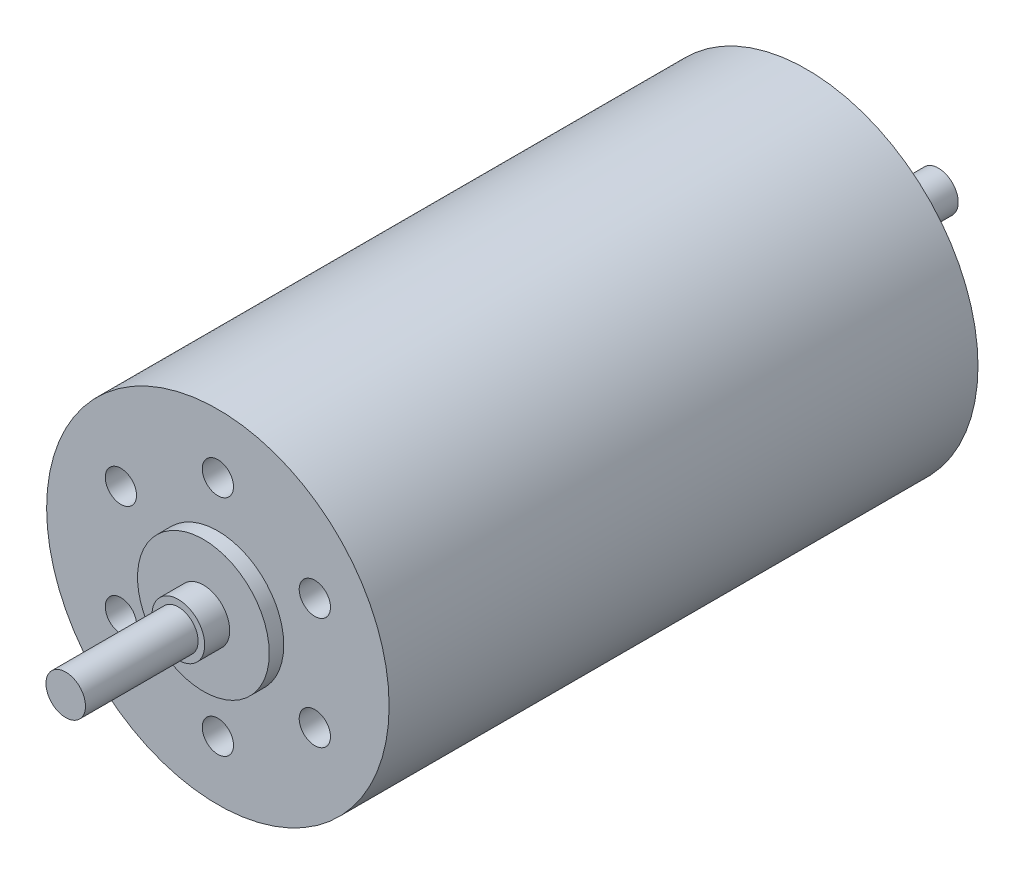
ISO-10303-21;
HEADER;
FILE_DESCRIPTION(('STEP AP214'),'2;1');
FILE_NAME('part.step','',(''),(''),'','','');
FILE_SCHEMA(('AUTOMOTIVE_DESIGN { 1 0 10303 214 1 1 1 1 }'));
ENDSEC;
DATA;
#1=APPLICATION_CONTEXT('core data for automotive mechanical design processes');
#2=APPLICATION_PROTOCOL_DEFINITION('international standard','automotive_design',2000,#1);
#3=PRODUCT_CONTEXT('',#1,'mechanical');
#4=PRODUCT('Part','Part','',(#3));
#5=PRODUCT_RELATED_PRODUCT_CATEGORY('part','',(#4));
#6=PRODUCT_DEFINITION_FORMATION('','',#4);
#7=PRODUCT_DEFINITION_CONTEXT('part definition',#1,'design');
#8=PRODUCT_DEFINITION('design','',#6,#7);
#9=PRODUCT_DEFINITION_SHAPE('','',#8);
#10=(LENGTH_UNIT() NAMED_UNIT(*) SI_UNIT(.MILLI.,.METRE.));
#11=(NAMED_UNIT(*) PLANE_ANGLE_UNIT() SI_UNIT($,.RADIAN.));
#12=(NAMED_UNIT(*) SI_UNIT($,.STERADIAN.) SOLID_ANGLE_UNIT());
#13=UNCERTAINTY_MEASURE_WITH_UNIT(LENGTH_MEASURE(1.E-05),#10,'distance_accuracy_value','');
#14=(GEOMETRIC_REPRESENTATION_CONTEXT(3) GLOBAL_UNCERTAINTY_ASSIGNED_CONTEXT((#13)) GLOBAL_UNIT_ASSIGNED_CONTEXT((#10,
#11,#12)) REPRESENTATION_CONTEXT('',''));
#15=CARTESIAN_POINT('',(0.,0.,0.));
#16=DIRECTION('',(0.,0.,1.));
#17=DIRECTION('',(1.,0.,0.));
#18=AXIS2_PLACEMENT_3D('',#15,#16,#17);
#19=CARTESIAN_POINT('',(0.,0.,22.35));
#20=DIRECTION('',(0.,0.,-1.));
#21=DIRECTION('',(-1.,0.,0.));
#22=AXIS2_PLACEMENT_3D('',#19,#20,#21);
#23=CYLINDRICAL_SURFACE('',#22,13.);
#24=CARTESIAN_POINT('',(0.,0.,22.35));
#25=DIRECTION('',(0.,0.,1.));
#26=DIRECTION('',(1.,0.,0.));
#27=AXIS2_PLACEMENT_3D('',#24,#25,#26);
#28=CIRCLE('',#27,13.);
#29=CARTESIAN_POINT('',(13.,0.,22.35));
#30=VERTEX_POINT('',#29);
#31=EDGE_CURVE('E165',#30,#30,#28,.T.);
#32=ORIENTED_EDGE('',*,*,#31,.F.);
#33=EDGE_LOOP('',(#32));
#34=FACE_BOUND('',#33,.T.);
#35=CARTESIAN_POINT('',(0.,0.,-22.35));
#36=DIRECTION('',(0.,0.,1.));
#37=DIRECTION('',(1.,0.,0.));
#38=AXIS2_PLACEMENT_3D('',#35,#36,#37);
#39=CIRCLE('',#38,13.);
#40=CARTESIAN_POINT('',(13.,0.,-22.35));
#41=VERTEX_POINT('',#40);
#42=EDGE_CURVE('E48',#41,#41,#39,.T.);
#43=ORIENTED_EDGE('',*,*,#42,.T.);
#44=EDGE_LOOP('',(#43));
#45=FACE_BOUND('',#44,.T.);
#46=ADVANCED_FACE('F45',(#34,#45),#23,.T.);
#47=CARTESIAN_POINT('',(0.,0.,22.35));
#48=DIRECTION('',(0.,0.,1.));
#49=DIRECTION('',(1.,0.,0.));
#50=AXIS2_PLACEMENT_3D('',#47,#48,#49);
#51=PLANE('',#50);
#52=CARTESIAN_POINT('',(7.36121593216774,-4.24999999999998,22.35));
#53=DIRECTION('',(0.,0.,1.));
#54=DIRECTION('',(1.,0.,0.));
#55=AXIS2_PLACEMENT_3D('',#52,#53,#54);
#56=CIRCLE('',#55,1.18744999999999);
#57=CARTESIAN_POINT('',(8.54866593216773,-4.24999999999998,22.35));
#58=VERTEX_POINT('',#57);
#59=EDGE_CURVE('E86',#58,#58,#56,.T.);
#60=ORIENTED_EDGE('',*,*,#59,.F.);
#61=EDGE_LOOP('',(#60));
#62=FACE_BOUND('',#61,.T.);
#63=CARTESIAN_POINT('',(0.,8.5,22.35));
#64=DIRECTION('',(0.,0.,1.));
#65=DIRECTION('',(1.,0.,0.));
#66=AXIS2_PLACEMENT_3D('',#63,#64,#65);
#67=CIRCLE('',#66,1.18744999999999);
#68=CARTESIAN_POINT('',(1.18744999999999,8.5,22.35));
#69=VERTEX_POINT('',#68);
#70=EDGE_CURVE('E85',#69,#69,#67,.T.);
#71=ORIENTED_EDGE('',*,*,#70,.F.);
#72=EDGE_LOOP('',(#71));
#73=FACE_BOUND('',#72,.T.);
#74=CARTESIAN_POINT('',(-7.36121593216774,4.24999999999998,22.35));
#75=DIRECTION('',(0.,0.,1.));
#76=DIRECTION('',(1.,0.,0.));
#77=AXIS2_PLACEMENT_3D('',#74,#75,#76);
#78=CIRCLE('',#77,1.18744999999999);
#79=CARTESIAN_POINT('',(-6.17376593216775,4.24999999999998,22.35));
#80=VERTEX_POINT('',#79);
#81=EDGE_CURVE('E99',#80,#80,#78,.T.);
#82=ORIENTED_EDGE('',*,*,#81,.F.);
#83=EDGE_LOOP('',(#82));
#84=FACE_BOUND('',#83,.T.);
#85=CARTESIAN_POINT('',(-7.36121593216774,-4.24999999999998,22.35));
#86=DIRECTION('',(0.,0.,1.));
#87=DIRECTION('',(1.,0.,0.));
#88=AXIS2_PLACEMENT_3D('',#85,#86,#87);
#89=CIRCLE('',#88,1.18744999999999);
#90=CARTESIAN_POINT('',(-6.17376593216775,-4.24999999999998,22.35));
#91=VERTEX_POINT('',#90);
#92=EDGE_CURVE('E107',#91,#91,#89,.T.);
#93=ORIENTED_EDGE('',*,*,#92,.F.);
#94=EDGE_LOOP('',(#93));
#95=FACE_BOUND('',#94,.T.);
#96=CARTESIAN_POINT('',(7.36121593216774,4.24999999999998,22.35));
#97=DIRECTION('',(0.,0.,1.));
#98=DIRECTION('',(1.,0.,0.));
#99=AXIS2_PLACEMENT_3D('',#96,#97,#98);
#100=CIRCLE('',#99,1.18744999999999);
#101=CARTESIAN_POINT('',(8.54866593216773,4.24999999999998,22.35));
#102=VERTEX_POINT('',#101);
#103=EDGE_CURVE('E115',#102,#102,#100,.T.);
#104=ORIENTED_EDGE('',*,*,#103,.F.);
#105=EDGE_LOOP('',(#104));
#106=FACE_BOUND('',#105,.T.);
#107=CARTESIAN_POINT('',(0.,-8.5,22.35));
#108=DIRECTION('',(0.,0.,1.));
#109=DIRECTION('',(1.,0.,0.));
#110=AXIS2_PLACEMENT_3D('',#107,#108,#109);
#111=CIRCLE('',#110,1.18744999999999);
#112=CARTESIAN_POINT('',(1.18744999999999,-8.5,22.35));
#113=VERTEX_POINT('',#112);
#114=EDGE_CURVE('E123',#113,#113,#111,.T.);
#115=ORIENTED_EDGE('',*,*,#114,.F.);
#116=EDGE_LOOP('',(#115));
#117=FACE_BOUND('',#116,.T.);
#118=CARTESIAN_POINT('',(0.,0.,22.35));
#119=DIRECTION('',(0.,0.,1.));
#120=DIRECTION('',(1.,0.,0.));
#121=AXIS2_PLACEMENT_3D('',#118,#119,#120);
#122=CIRCLE('',#121,5.);
#123=CARTESIAN_POINT('',(5.,0.,22.35));
#124=VERTEX_POINT('',#123);
#125=EDGE_CURVE('E159',#124,#124,#122,.T.);
#126=ORIENTED_EDGE('',*,*,#125,.F.);
#127=EDGE_LOOP('',(#126));
#128=FACE_BOUND('',#127,.T.);
#129=ORIENTED_EDGE('',*,*,#31,.T.);
#130=EDGE_LOOP('',(#129));
#131=FACE_BOUND('',#130,.T.);
#132=ADVANCED_FACE('F178',(#62,#73,#84,#95,#106,#117,#128,#131),#51,.T.);
#133=CARTESIAN_POINT('',(0.,0.,-22.35));
#134=DIRECTION('',(0.,0.,1.));
#135=DIRECTION('',(1.,0.,0.));
#136=AXIS2_PLACEMENT_3D('',#133,#134,#135);
#137=PLANE('',#136);
#138=CARTESIAN_POINT('',(0.,0.,-22.35));
#139=DIRECTION('',(0.,0.,-1.));
#140=DIRECTION('',(-1.,0.,0.));
#141=AXIS2_PLACEMENT_3D('',#138,#139,#140);
#142=CIRCLE('',#141,4.);
#143=CARTESIAN_POINT('',(-4.,0.,-22.35));
#144=VERTEX_POINT('',#143);
#145=EDGE_CURVE('E54',#144,#144,#142,.T.);
#146=ORIENTED_EDGE('',*,*,#145,.F.);
#147=EDGE_LOOP('',(#146));
#148=FACE_BOUND('',#147,.T.);
#149=ORIENTED_EDGE('',*,*,#42,.F.);
#150=EDGE_LOOP('',(#149));
#151=FACE_BOUND('',#150,.T.);
#152=ADVANCED_FACE('F175',(#148,#151),#137,.F.);
#153=CARTESIAN_POINT('',(0.,0.,23.45));
#154=DIRECTION('',(0.,0.,-1.));
#155=DIRECTION('',(-1.,0.,0.));
#156=AXIS2_PLACEMENT_3D('',#153,#154,#155);
#157=CYLINDRICAL_SURFACE('',#156,5.);
#158=CARTESIAN_POINT('',(0.,0.,23.45));
#159=DIRECTION('',(0.,0.,1.));
#160=DIRECTION('',(1.,0.,0.));
#161=AXIS2_PLACEMENT_3D('',#158,#159,#160);
#162=CIRCLE('',#161,5.);
#163=CARTESIAN_POINT('',(5.,0.,23.45));
#164=VERTEX_POINT('',#163);
#165=EDGE_CURVE('E155',#164,#164,#162,.T.);
#166=ORIENTED_EDGE('',*,*,#165,.F.);
#167=EDGE_LOOP('',(#166));
#168=FACE_BOUND('',#167,.T.);
#169=ORIENTED_EDGE('',*,*,#125,.T.);
#170=EDGE_LOOP('',(#169));
#171=FACE_BOUND('',#170,.T.);
#172=ADVANCED_FACE('F177',(#168,#171),#157,.T.);
#173=CARTESIAN_POINT('',(0.,0.,23.45));
#174=DIRECTION('',(0.,0.,1.));
#175=DIRECTION('',(1.,0.,0.));
#176=AXIS2_PLACEMENT_3D('',#173,#174,#175);
#177=PLANE('',#176);
#178=CARTESIAN_POINT('',(0.,0.,23.45));
#179=DIRECTION('',(0.,0.,1.));
#180=DIRECTION('',(1.,0.,0.));
#181=AXIS2_PLACEMENT_3D('',#178,#179,#180);
#182=CIRCLE('',#181,2.);
#183=CARTESIAN_POINT('',(2.,0.,23.45));
#184=VERTEX_POINT('',#183);
#185=EDGE_CURVE('E151',#184,#184,#182,.T.);
#186=ORIENTED_EDGE('',*,*,#185,.F.);
#187=EDGE_LOOP('',(#186));
#188=FACE_BOUND('',#187,.T.);
#189=ORIENTED_EDGE('',*,*,#165,.T.);
#190=EDGE_LOOP('',(#189));
#191=FACE_BOUND('',#190,.T.);
#192=ADVANCED_FACE('F185',(#188,#191),#177,.T.);
#193=CARTESIAN_POINT('',(0.,0.,25.35));
#194=DIRECTION('',(0.,0.,-1.));
#195=DIRECTION('',(-1.,0.,0.));
#196=AXIS2_PLACEMENT_3D('',#193,#194,#195);
#197=CYLINDRICAL_SURFACE('',#196,2.);
#198=CARTESIAN_POINT('',(0.,0.,25.35));
#199=DIRECTION('',(0.,0.,1.));
#200=DIRECTION('',(1.,0.,0.));
#201=AXIS2_PLACEMENT_3D('',#198,#199,#200);
#202=CIRCLE('',#201,2.);
#203=CARTESIAN_POINT('',(2.,0.,25.35));
#204=VERTEX_POINT('',#203);
#205=EDGE_CURVE('E147',#204,#204,#202,.T.);
#206=ORIENTED_EDGE('',*,*,#205,.F.);
#207=EDGE_LOOP('',(#206));
#208=FACE_BOUND('',#207,.T.);
#209=ORIENTED_EDGE('',*,*,#185,.T.);
#210=EDGE_LOOP('',(#209));
#211=FACE_BOUND('',#210,.T.);
#212=ADVANCED_FACE('F209',(#208,#211),#197,.T.);
#213=CARTESIAN_POINT('',(0.,0.,25.35));
#214=DIRECTION('',(0.,0.,1.));
#215=DIRECTION('',(1.,0.,0.));
#216=AXIS2_PLACEMENT_3D('',#213,#214,#215);
#217=PLANE('',#216);
#218=CARTESIAN_POINT('',(0.,0.,25.35));
#219=DIRECTION('',(0.,0.,1.));
#220=DIRECTION('',(1.,0.,0.));
#221=AXIS2_PLACEMENT_3D('',#218,#219,#220);
#222=CIRCLE('',#221,1.5);
#223=CARTESIAN_POINT('',(1.5,0.,25.35));
#224=VERTEX_POINT('',#223);
#225=EDGE_CURVE('E143',#224,#224,#222,.T.);
#226=ORIENTED_EDGE('',*,*,#225,.F.);
#227=EDGE_LOOP('',(#226));
#228=FACE_BOUND('',#227,.T.);
#229=ORIENTED_EDGE('',*,*,#205,.T.);
#230=EDGE_LOOP('',(#229));
#231=FACE_BOUND('',#230,.T.);
#232=ADVANCED_FACE('F218',(#228,#231),#217,.T.);
#233=CARTESIAN_POINT('',(0.,0.,33.9));
#234=DIRECTION('',(0.,0.,-1.));
#235=DIRECTION('',(-1.,0.,0.));
#236=AXIS2_PLACEMENT_3D('',#233,#234,#235);
#237=CYLINDRICAL_SURFACE('',#236,1.5);
#238=CARTESIAN_POINT('',(0.,0.,33.9));
#239=DIRECTION('',(0.,0.,1.));
#240=DIRECTION('',(1.,0.,0.));
#241=AXIS2_PLACEMENT_3D('',#238,#239,#240);
#242=CIRCLE('',#241,1.5);
#243=CARTESIAN_POINT('',(1.5,0.,33.9));
#244=VERTEX_POINT('',#243);
#245=EDGE_CURVE('E139',#244,#244,#242,.T.);
#246=ORIENTED_EDGE('',*,*,#245,.F.);
#247=EDGE_LOOP('',(#246));
#248=FACE_BOUND('',#247,.T.);
#249=ORIENTED_EDGE('',*,*,#225,.T.);
#250=EDGE_LOOP('',(#249));
#251=FACE_BOUND('',#250,.T.);
#252=ADVANCED_FACE('F227',(#248,#251),#237,.T.);
#253=CARTESIAN_POINT('',(0.,0.,33.9));
#254=DIRECTION('',(0.,0.,1.));
#255=DIRECTION('',(1.,0.,0.));
#256=AXIS2_PLACEMENT_3D('',#253,#254,#255);
#257=PLANE('',#256);
#258=ORIENTED_EDGE('',*,*,#245,.T.);
#259=EDGE_LOOP('',(#258));
#260=FACE_BOUND('',#259,.T.);
#261=ADVANCED_FACE('F235',(#260),#257,.T.);
#262=CARTESIAN_POINT('',(0.,0.,-24.55));
#263=DIRECTION('',(0.,0.,1.));
#264=DIRECTION('',(1.,0.,0.));
#265=AXIS2_PLACEMENT_3D('',#262,#263,#264);
#266=CYLINDRICAL_SURFACE('',#265,4.);
#267=CARTESIAN_POINT('',(0.,0.,-24.55));
#268=DIRECTION('',(0.,0.,-1.));
#269=DIRECTION('',(-1.,0.,0.));
#270=AXIS2_PLACEMENT_3D('',#267,#268,#269);
#271=CIRCLE('',#270,4.);
#272=CARTESIAN_POINT('',(-4.,0.,-24.55));
#273=VERTEX_POINT('',#272);
#274=EDGE_CURVE('E134',#273,#273,#271,.T.);
#275=ORIENTED_EDGE('',*,*,#274,.F.);
#276=EDGE_LOOP('',(#275));
#277=FACE_BOUND('',#276,.T.);
#278=ORIENTED_EDGE('',*,*,#145,.T.);
#279=EDGE_LOOP('',(#278));
#280=FACE_BOUND('',#279,.T.);
#281=ADVANCED_FACE('F243',(#277,#280),#266,.T.);
#282=CARTESIAN_POINT('',(0.,0.,-24.55));
#283=DIRECTION('',(0.,0.,-1.));
#284=DIRECTION('',(-1.,0.,0.));
#285=AXIS2_PLACEMENT_3D('',#282,#283,#284);
#286=PLANE('',#285);
#287=CARTESIAN_POINT('',(0.,0.,-24.55));
#288=DIRECTION('',(0.,0.,-1.));
#289=DIRECTION('',(-1.,0.,0.));
#290=AXIS2_PLACEMENT_3D('',#287,#288,#289);
#291=CIRCLE('',#290,1.5);
#292=CARTESIAN_POINT('',(-1.5,0.,-24.55));
#293=VERTEX_POINT('',#292);
#294=EDGE_CURVE('E11',#293,#293,#291,.T.);
#295=ORIENTED_EDGE('',*,*,#294,.F.);
#296=EDGE_LOOP('',(#295));
#297=FACE_BOUND('',#296,.T.);
#298=ORIENTED_EDGE('',*,*,#274,.T.);
#299=EDGE_LOOP('',(#298));
#300=FACE_BOUND('',#299,.T.);
#301=ADVANCED_FACE('F255',(#297,#300),#286,.T.);
#302=CARTESIAN_POINT('',(0.,0.,-32.35));
#303=DIRECTION('',(0.,0.,1.));
#304=DIRECTION('',(1.,0.,0.));
#305=AXIS2_PLACEMENT_3D('',#302,#303,#304);
#306=CYLINDRICAL_SURFACE('',#305,1.5);
#307=CARTESIAN_POINT('',(0.,0.,-32.35));
#308=DIRECTION('',(0.,0.,-1.));
#309=DIRECTION('',(-1.,0.,0.));
#310=AXIS2_PLACEMENT_3D('',#307,#308,#309);
#311=CIRCLE('',#310,1.5);
#312=CARTESIAN_POINT('',(-1.5,0.,-32.35));
#313=VERTEX_POINT('',#312);
#314=EDGE_CURVE('E131',#313,#313,#311,.T.);
#315=ORIENTED_EDGE('',*,*,#314,.F.);
#316=EDGE_LOOP('',(#315));
#317=FACE_BOUND('',#316,.T.);
#318=ORIENTED_EDGE('',*,*,#294,.T.);
#319=EDGE_LOOP('',(#318));
#320=FACE_BOUND('',#319,.T.);
#321=ADVANCED_FACE('F265',(#317,#320),#306,.T.);
#322=CARTESIAN_POINT('',(0.,0.,-32.35));
#323=DIRECTION('',(0.,0.,-1.));
#324=DIRECTION('',(-1.,0.,0.));
#325=AXIS2_PLACEMENT_3D('',#322,#323,#324);
#326=PLANE('',#325);
#327=ORIENTED_EDGE('',*,*,#314,.T.);
#328=EDGE_LOOP('',(#327));
#329=FACE_BOUND('',#328,.T.);
#330=ADVANCED_FACE('F275',(#329),#326,.T.);
#331=CARTESIAN_POINT('',(0.,-8.5,9.65000000000001));
#332=DIRECTION('',(0.,0.,1.));
#333=DIRECTION('',(1.,0.,0.));
#334=AXIS2_PLACEMENT_3D('',#331,#332,#333);
#335=CONICAL_SURFACE('',#334,1.18744999999999,1.02974425867665);
#336=CARTESIAN_POINT('',(0.,-8.5,8.93650805793573));
#337=VERTEX_POINT('',#336);
#338=VERTEX_LOOP('',#337);
#339=FACE_BOUND('',#338,.T.);
#340=CARTESIAN_POINT('',(0.,-8.5,9.65000000000001));
#341=DIRECTION('',(0.,0.,1.));
#342=DIRECTION('',(1.,0.,0.));
#343=AXIS2_PLACEMENT_3D('',#340,#341,#342);
#344=CIRCLE('',#343,1.18744999999999);
#345=CARTESIAN_POINT('',(1.18744999999999,-8.5,9.65000000000001));
#346=VERTEX_POINT('',#345);
#347=EDGE_CURVE('E127',#346,#346,#344,.T.);
#348=ORIENTED_EDGE('',*,*,#347,.T.);
#349=EDGE_LOOP('',(#348));
#350=FACE_BOUND('',#349,.T.);
#351=ADVANCED_FACE('F285',(#339,#350),#335,.F.);
#352=CARTESIAN_POINT('',(0.,-8.5,22.35));
#353=DIRECTION('',(0.,0.,1.));
#354=DIRECTION('',(1.,0.,0.));
#355=AXIS2_PLACEMENT_3D('',#352,#353,#354);
#356=CYLINDRICAL_SURFACE('',#355,1.18744999999999);
#357=ORIENTED_EDGE('',*,*,#347,.F.);
#358=EDGE_LOOP('',(#357));
#359=FACE_BOUND('',#358,.T.);
#360=ORIENTED_EDGE('',*,*,#114,.T.);
#361=EDGE_LOOP('',(#360));
#362=FACE_BOUND('',#361,.T.);
#363=ADVANCED_FACE('F295',(#359,#362),#356,.F.);
#364=CARTESIAN_POINT('',(7.36121593216774,4.24999999999998,9.65000000000001));
#365=DIRECTION('',(0.,0.,1.));
#366=DIRECTION('',(1.,0.,0.));
#367=AXIS2_PLACEMENT_3D('',#364,#365,#366);
#368=CONICAL_SURFACE('',#367,1.18744999999999,1.02974425867665);
#369=CARTESIAN_POINT('',(7.36121593216773,4.24999999999998,8.93650805793573));
#370=VERTEX_POINT('',#369);
#371=VERTEX_LOOP('',#370);
#372=FACE_BOUND('',#371,.T.);
#373=CARTESIAN_POINT('',(7.36121593216774,4.24999999999998,9.65000000000001));
#374=DIRECTION('',(0.,0.,1.));
#375=DIRECTION('',(1.,0.,0.));
#376=AXIS2_PLACEMENT_3D('',#373,#374,#375);
#377=CIRCLE('',#376,1.18744999999999);
#378=CARTESIAN_POINT('',(8.54866593216773,4.24999999999998,9.65000000000001));
#379=VERTEX_POINT('',#378);
#380=EDGE_CURVE('E119',#379,#379,#377,.T.);
#381=ORIENTED_EDGE('',*,*,#380,.T.);
#382=EDGE_LOOP('',(#381));
#383=FACE_BOUND('',#382,.T.);
#384=ADVANCED_FACE('F304',(#372,#383),#368,.F.);
#385=CARTESIAN_POINT('',(7.36121593216774,4.24999999999998,22.35));
#386=DIRECTION('',(0.,0.,1.));
#387=DIRECTION('',(1.,0.,0.));
#388=AXIS2_PLACEMENT_3D('',#385,#386,#387);
#389=CYLINDRICAL_SURFACE('',#388,1.18744999999999);
#390=ORIENTED_EDGE('',*,*,#380,.F.);
#391=EDGE_LOOP('',(#390));
#392=FACE_BOUND('',#391,.T.);
#393=ORIENTED_EDGE('',*,*,#103,.T.);
#394=EDGE_LOOP('',(#393));
#395=FACE_BOUND('',#394,.T.);
#396=ADVANCED_FACE('F314',(#392,#395),#389,.F.);
#397=CARTESIAN_POINT('',(-7.36121593216774,-4.24999999999998,9.65000000000001));
#398=DIRECTION('',(0.,0.,1.));
#399=DIRECTION('',(1.,0.,0.));
#400=AXIS2_PLACEMENT_3D('',#397,#398,#399);
#401=CONICAL_SURFACE('',#400,1.18744999999999,1.02974425867665);
#402=CARTESIAN_POINT('',(-7.36121593216774,-4.24999999999998,8.93650805793573));
#403=VERTEX_POINT('',#402);
#404=VERTEX_LOOP('',#403);
#405=FACE_BOUND('',#404,.T.);
#406=CARTESIAN_POINT('',(-7.36121593216774,-4.24999999999998,9.65000000000001));
#407=DIRECTION('',(0.,0.,1.));
#408=DIRECTION('',(1.,0.,0.));
#409=AXIS2_PLACEMENT_3D('',#406,#407,#408);
#410=CIRCLE('',#409,1.18744999999999);
#411=CARTESIAN_POINT('',(-6.17376593216775,-4.24999999999998,9.65000000000001));
#412=VERTEX_POINT('',#411);
#413=EDGE_CURVE('E111',#412,#412,#410,.T.);
#414=ORIENTED_EDGE('',*,*,#413,.T.);
#415=EDGE_LOOP('',(#414));
#416=FACE_BOUND('',#415,.T.);
#417=ADVANCED_FACE('F323',(#405,#416),#401,.F.);
#418=CARTESIAN_POINT('',(-7.36121593216774,-4.24999999999998,22.35));
#419=DIRECTION('',(0.,0.,1.));
#420=DIRECTION('',(1.,0.,0.));
#421=AXIS2_PLACEMENT_3D('',#418,#419,#420);
#422=CYLINDRICAL_SURFACE('',#421,1.18744999999999);
#423=ORIENTED_EDGE('',*,*,#413,.F.);
#424=EDGE_LOOP('',(#423));
#425=FACE_BOUND('',#424,.T.);
#426=ORIENTED_EDGE('',*,*,#92,.T.);
#427=EDGE_LOOP('',(#426));
#428=FACE_BOUND('',#427,.T.);
#429=ADVANCED_FACE('F333',(#425,#428),#422,.F.);
#430=CARTESIAN_POINT('',(-7.36121593216774,4.24999999999998,9.65000000000001));
#431=DIRECTION('',(0.,0.,1.));
#432=DIRECTION('',(1.,0.,0.));
#433=AXIS2_PLACEMENT_3D('',#430,#431,#432);
#434=CONICAL_SURFACE('',#433,1.18744999999999,1.02974425867665);
#435=CARTESIAN_POINT('',(-7.36121593216774,4.24999999999998,8.93650805793573));
#436=VERTEX_POINT('',#435);
#437=VERTEX_LOOP('',#436);
#438=FACE_BOUND('',#437,.T.);
#439=CARTESIAN_POINT('',(-7.36121593216774,4.24999999999998,9.65000000000001));
#440=DIRECTION('',(0.,0.,1.));
#441=DIRECTION('',(1.,0.,0.));
#442=AXIS2_PLACEMENT_3D('',#439,#440,#441);
#443=CIRCLE('',#442,1.18744999999999);
#444=CARTESIAN_POINT('',(-6.17376593216775,4.24999999999998,9.65000000000001));
#445=VERTEX_POINT('',#444);
#446=EDGE_CURVE('E103',#445,#445,#443,.T.);
#447=ORIENTED_EDGE('',*,*,#446,.T.);
#448=EDGE_LOOP('',(#447));
#449=FACE_BOUND('',#448,.T.);
#450=ADVANCED_FACE('F343',(#438,#449),#434,.F.);
#451=CARTESIAN_POINT('',(-7.36121593216774,4.24999999999998,22.35));
#452=DIRECTION('',(0.,0.,1.));
#453=DIRECTION('',(1.,0.,0.));
#454=AXIS2_PLACEMENT_3D('',#451,#452,#453);
#455=CYLINDRICAL_SURFACE('',#454,1.18744999999999);
#456=ORIENTED_EDGE('',*,*,#446,.F.);
#457=EDGE_LOOP('',(#456));
#458=FACE_BOUND('',#457,.T.);
#459=ORIENTED_EDGE('',*,*,#81,.T.);
#460=EDGE_LOOP('',(#459));
#461=FACE_BOUND('',#460,.T.);
#462=ADVANCED_FACE('F353',(#458,#461),#455,.F.);
#463=CARTESIAN_POINT('',(0.,8.5,9.65000000000001));
#464=DIRECTION('',(0.,0.,1.));
#465=DIRECTION('',(1.,0.,0.));
#466=AXIS2_PLACEMENT_3D('',#463,#464,#465);
#467=CONICAL_SURFACE('',#466,1.18744999999999,1.02974425867665);
#468=CARTESIAN_POINT('',(0.,8.5,8.93650805793573));
#469=VERTEX_POINT('',#468);
#470=VERTEX_LOOP('',#469);
#471=FACE_BOUND('',#470,.T.);
#472=CARTESIAN_POINT('',(0.,8.5,9.65000000000001));
#473=DIRECTION('',(0.,0.,1.));
#474=DIRECTION('',(1.,0.,0.));
#475=AXIS2_PLACEMENT_3D('',#472,#473,#474);
#476=CIRCLE('',#475,1.18744999999999);
#477=CARTESIAN_POINT('',(1.18744999999999,8.5,9.65000000000001));
#478=VERTEX_POINT('',#477);
#479=EDGE_CURVE('E91',#478,#478,#476,.T.);
#480=ORIENTED_EDGE('',*,*,#479,.T.);
#481=EDGE_LOOP('',(#480));
#482=FACE_BOUND('',#481,.T.);
#483=ADVANCED_FACE('F363',(#471,#482),#467,.F.);
#484=CARTESIAN_POINT('',(0.,8.5,22.35));
#485=DIRECTION('',(0.,0.,1.));
#486=DIRECTION('',(1.,0.,0.));
#487=AXIS2_PLACEMENT_3D('',#484,#485,#486);
#488=CYLINDRICAL_SURFACE('',#487,1.18744999999999);
#489=ORIENTED_EDGE('',*,*,#479,.F.);
#490=EDGE_LOOP('',(#489));
#491=FACE_BOUND('',#490,.T.);
#492=ORIENTED_EDGE('',*,*,#70,.T.);
#493=EDGE_LOOP('',(#492));
#494=FACE_BOUND('',#493,.T.);
#495=ADVANCED_FACE('F78',(#491,#494),#488,.F.);
#496=CARTESIAN_POINT('',(7.36121593216774,-4.24999999999998,9.65000000000001));
#497=DIRECTION('',(0.,0.,1.));
#498=DIRECTION('',(1.,0.,0.));
#499=AXIS2_PLACEMENT_3D('',#496,#497,#498);
#500=CONICAL_SURFACE('',#499,1.18744999999999,1.02974425867665);
#501=CARTESIAN_POINT('',(7.36121593216774,-4.24999999999998,8.93650805793573));
#502=VERTEX_POINT('',#501);
#503=VERTEX_LOOP('',#502);
#504=FACE_BOUND('',#503,.T.);
#505=CARTESIAN_POINT('',(7.36121593216774,-4.24999999999998,9.65000000000001));
#506=DIRECTION('',(0.,0.,1.));
#507=DIRECTION('',(1.,0.,0.));
#508=AXIS2_PLACEMENT_3D('',#505,#506,#507);
#509=CIRCLE('',#508,1.18744999999999);
#510=CARTESIAN_POINT('',(8.54866593216773,-4.24999999999998,9.65000000000001));
#511=VERTEX_POINT('',#510);
#512=EDGE_CURVE('E82',#511,#511,#509,.T.);
#513=ORIENTED_EDGE('',*,*,#512,.T.);
#514=EDGE_LOOP('',(#513));
#515=FACE_BOUND('',#514,.T.);
#516=ADVANCED_FACE('F74',(#504,#515),#500,.F.);
#517=CARTESIAN_POINT('',(7.36121593216774,-4.24999999999998,22.35));
#518=DIRECTION('',(0.,0.,1.));
#519=DIRECTION('',(1.,0.,0.));
#520=AXIS2_PLACEMENT_3D('',#517,#518,#519);
#521=CYLINDRICAL_SURFACE('',#520,1.18744999999999);
#522=ORIENTED_EDGE('',*,*,#512,.F.);
#523=EDGE_LOOP('',(#522));
#524=FACE_BOUND('',#523,.T.);
#525=ORIENTED_EDGE('',*,*,#59,.T.);
#526=EDGE_LOOP('',(#525));
#527=FACE_BOUND('',#526,.T.);
#528=ADVANCED_FACE('F77',(#524,#527),#521,.F.);
#529=CLOSED_SHELL('',(#46,#132,#152,#172,#192,#212,#232,#252,#261,#281,#301,#321,#330,#351,#363,
#384,#396,#417,#429,#450,#462,#483,#495,#516,#528));
#530=MANIFOLD_SOLID_BREP('B2',#529);
#531=ADVANCED_BREP_SHAPE_REPRESENTATION('',(#18,#530),#14);
#532=SHAPE_DEFINITION_REPRESENTATION(#9,#531);
ENDSEC;
END-ISO-10303-21;
